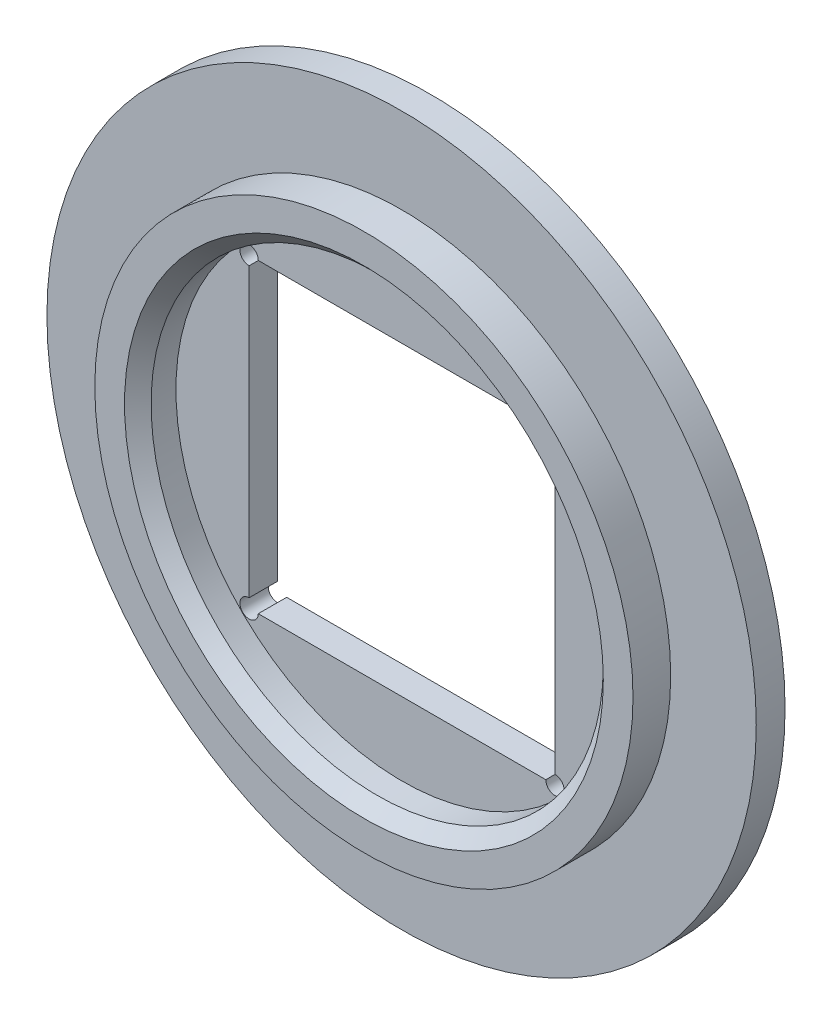
ISO-10303-21;
HEADER;
FILE_DESCRIPTION(('STEP AP214'),'2;1');
FILE_NAME('part.step','',(''),(''),'','','');
FILE_SCHEMA(('AUTOMOTIVE_DESIGN { 1 0 10303 214 1 1 1 1 }'));
ENDSEC;
DATA;
#1=APPLICATION_CONTEXT('core data for automotive mechanical design processes');
#2=APPLICATION_PROTOCOL_DEFINITION('international standard','automotive_design',2000,#1);
#3=PRODUCT_CONTEXT('',#1,'mechanical');
#4=PRODUCT('Part','Part','',(#3));
#5=PRODUCT_RELATED_PRODUCT_CATEGORY('part','',(#4));
#6=PRODUCT_DEFINITION_FORMATION('','',#4);
#7=PRODUCT_DEFINITION_CONTEXT('part definition',#1,'design');
#8=PRODUCT_DEFINITION('design','',#6,#7);
#9=PRODUCT_DEFINITION_SHAPE('','',#8);
#10=(LENGTH_UNIT() NAMED_UNIT(*) SI_UNIT(.MILLI.,.METRE.));
#11=(NAMED_UNIT(*) PLANE_ANGLE_UNIT() SI_UNIT($,.RADIAN.));
#12=(NAMED_UNIT(*) SI_UNIT($,.STERADIAN.) SOLID_ANGLE_UNIT());
#13=UNCERTAINTY_MEASURE_WITH_UNIT(LENGTH_MEASURE(1.E-05),#10,'distance_accuracy_value','');
#14=(GEOMETRIC_REPRESENTATION_CONTEXT(3) GLOBAL_UNCERTAINTY_ASSIGNED_CONTEXT((#13)) GLOBAL_UNIT_ASSIGNED_CONTEXT((#10,
#11,#12)) REPRESENTATION_CONTEXT('',''));
#15=CARTESIAN_POINT('',(0.,0.,0.));
#16=DIRECTION('',(0.,0.,1.));
#17=DIRECTION('',(1.,0.,0.));
#18=AXIS2_PLACEMENT_3D('',#15,#16,#17);
#19=CARTESIAN_POINT('',(3.45,-3.45,10.3980735803744));
#20=DIRECTION('',(-1.,0.,0.));
#21=DIRECTION('',(0.,0.,1.));
#22=AXIS2_PLACEMENT_3D('',#19,#20,#21);
#23=PLANE('',#22);
#24=DIRECTION('',(0.,1.,0.));
#25=VECTOR('',#24,1.);
#26=CARTESIAN_POINT('',(3.45,-3.45,0.));
#27=LINE('',#26,#25);
#28=CARTESIAN_POINT('',(3.45,-3.2426364551647,0.));
#29=VERTEX_POINT('',#28);
#30=CARTESIAN_POINT('',(3.45,3.2426364551647,0.));
#31=VERTEX_POINT('',#30);
#32=EDGE_CURVE('E131',#29,#31,#27,.T.);
#33=ORIENTED_EDGE('',*,*,#32,.F.);
#34=DIRECTION('',(0.,0.,-1.));
#35=VECTOR('',#34,1.);
#36=CARTESIAN_POINT('',(3.45,-3.2426364551647,1.22651267489567));
#37=LINE('',#36,#35);
#38=CARTESIAN_POINT('',(3.45,-3.2426364551647,0.64));
#39=VERTEX_POINT('',#38);
#40=EDGE_CURVE('E113',#29,#39,#37,.F.);
#41=ORIENTED_EDGE('',*,*,#40,.T.);
#42=DIRECTION('',(0.,1.,0.));
#43=VECTOR('',#42,1.);
#44=CARTESIAN_POINT('',(3.45,-3.45,0.64));
#45=LINE('',#44,#43);
#46=CARTESIAN_POINT('',(3.45,3.2426364551647,0.64));
#47=VERTEX_POINT('',#46);
#48=EDGE_CURVE('E129',#39,#47,#45,.T.);
#49=ORIENTED_EDGE('',*,*,#48,.T.);
#50=DIRECTION('',(0.,0.,-1.));
#51=VECTOR('',#50,1.);
#52=CARTESIAN_POINT('',(3.45,3.2426364551647,1.22651267489567));
#53=LINE('',#52,#51);
#54=EDGE_CURVE('E207',#47,#31,#53,.T.);
#55=ORIENTED_EDGE('',*,*,#54,.T.);
#56=EDGE_LOOP('',(#33,#41,#49,#55));
#57=FACE_BOUND('',#56,.T.);
#58=ADVANCED_FACE('F45',(#57),#23,.T.);
#59=CARTESIAN_POINT('',(-3.45,3.45,10.3980735803744));
#60=DIRECTION('',(0.,-1.,0.));
#61=DIRECTION('',(1.,0.,0.));
#62=AXIS2_PLACEMENT_3D('',#59,#60,#61);
#63=PLANE('',#62);
#64=DIRECTION('',(-1.,0.,0.));
#65=VECTOR('',#64,1.);
#66=CARTESIAN_POINT('',(-3.45,3.45,0.));
#67=LINE('',#66,#65);
#68=CARTESIAN_POINT('',(3.24263645516471,3.45,0.));
#69=VERTEX_POINT('',#68);
#70=CARTESIAN_POINT('',(-3.2426364551647,3.45,0.));
#71=VERTEX_POINT('',#70);
#72=EDGE_CURVE('E206',#69,#71,#67,.T.);
#73=ORIENTED_EDGE('',*,*,#72,.F.);
#74=DIRECTION('',(0.,0.,-1.));
#75=VECTOR('',#74,1.);
#76=CARTESIAN_POINT('',(3.24263645516471,3.45,1.22651267489567));
#77=LINE('',#76,#75);
#78=CARTESIAN_POINT('',(3.24263645516471,3.45,0.64));
#79=VERTEX_POINT('',#78);
#80=EDGE_CURVE('E11',#69,#79,#77,.F.);
#81=ORIENTED_EDGE('',*,*,#80,.T.);
#82=DIRECTION('',(-1.,0.,0.));
#83=VECTOR('',#82,1.);
#84=CARTESIAN_POINT('',(-3.45,3.45,0.64));
#85=LINE('',#84,#83);
#86=CARTESIAN_POINT('',(-3.2426364551647,3.45,0.64));
#87=VERTEX_POINT('',#86);
#88=EDGE_CURVE('E139',#79,#87,#85,.T.);
#89=ORIENTED_EDGE('',*,*,#88,.T.);
#90=DIRECTION('',(0.,0.,-1.));
#91=VECTOR('',#90,1.);
#92=CARTESIAN_POINT('',(-3.2426364551647,3.45,1.22651267489567));
#93=LINE('',#92,#91);
#94=EDGE_CURVE('E218',#87,#71,#93,.T.);
#95=ORIENTED_EDGE('',*,*,#94,.T.);
#96=EDGE_LOOP('',(#73,#81,#89,#95));
#97=FACE_BOUND('',#96,.T.);
#98=ADVANCED_FACE('F244',(#97),#63,.T.);
#99=CARTESIAN_POINT('',(-3.45,3.45,10.3980735803744));
#100=DIRECTION('',(1.,0.,0.));
#101=DIRECTION('',(0.,1.,0.));
#102=AXIS2_PLACEMENT_3D('',#99,#100,#101);
#103=PLANE('',#102);
#104=DIRECTION('',(0.,-1.,0.));
#105=VECTOR('',#104,1.);
#106=CARTESIAN_POINT('',(-3.45,3.45,0.64));
#107=LINE('',#106,#105);
#108=CARTESIAN_POINT('',(-3.45,3.2426364551647,0.64));
#109=VERTEX_POINT('',#108);
#110=CARTESIAN_POINT('',(-3.45,-3.2426364551647,0.64));
#111=VERTEX_POINT('',#110);
#112=EDGE_CURVE('E147',#109,#111,#107,.T.);
#113=ORIENTED_EDGE('',*,*,#112,.T.);
#114=DIRECTION('',(0.,0.,-1.));
#115=VECTOR('',#114,1.);
#116=CARTESIAN_POINT('',(-3.45,-3.2426364551647,1.22651267489567));
#117=LINE('',#116,#115);
#118=CARTESIAN_POINT('',(-3.45,-3.2426364551647,0.));
#119=VERTEX_POINT('',#118);
#120=EDGE_CURVE('E133',#111,#119,#117,.T.);
#121=ORIENTED_EDGE('',*,*,#120,.T.);
#122=DIRECTION('',(0.,-1.,0.));
#123=VECTOR('',#122,1.);
#124=CARTESIAN_POINT('',(-3.45,3.45,0.));
#125=LINE('',#124,#123);
#126=CARTESIAN_POINT('',(-3.45,3.2426364551647,0.));
#127=VERTEX_POINT('',#126);
#128=EDGE_CURVE('E195',#127,#119,#125,.T.);
#129=ORIENTED_EDGE('',*,*,#128,.F.);
#130=DIRECTION('',(0.,0.,-1.));
#131=VECTOR('',#130,1.);
#132=CARTESIAN_POINT('',(-3.45,3.2426364551647,1.22651267489567));
#133=LINE('',#132,#131);
#134=EDGE_CURVE('E55',#127,#109,#133,.F.);
#135=ORIENTED_EDGE('',*,*,#134,.T.);
#136=EDGE_LOOP('',(#113,#121,#129,#135));
#137=FACE_BOUND('',#136,.T.);
#138=ADVANCED_FACE('F192',(#137),#103,.T.);
#139=CARTESIAN_POINT('',(-3.45,-3.45,10.3980735803744));
#140=DIRECTION('',(0.,1.,0.));
#141=DIRECTION('',(0.,0.,1.));
#142=AXIS2_PLACEMENT_3D('',#139,#140,#141);
#143=PLANE('',#142);
#144=DIRECTION('',(1.,0.,0.));
#145=VECTOR('',#144,1.);
#146=CARTESIAN_POINT('',(-3.45,-3.45,0.));
#147=LINE('',#146,#145);
#148=CARTESIAN_POINT('',(-3.24263645516471,-3.45,0.));
#149=VERTEX_POINT('',#148);
#150=CARTESIAN_POINT('',(3.2426364551647,-3.45,0.));
#151=VERTEX_POINT('',#150);
#152=EDGE_CURVE('E150',#149,#151,#147,.T.);
#153=ORIENTED_EDGE('',*,*,#152,.F.);
#154=DIRECTION('',(0.,0.,-1.));
#155=VECTOR('',#154,1.);
#156=CARTESIAN_POINT('',(-3.24263645516471,-3.45,1.22651267489567));
#157=LINE('',#156,#155);
#158=CARTESIAN_POINT('',(-3.24263645516471,-3.45,0.64));
#159=VERTEX_POINT('',#158);
#160=EDGE_CURVE('E183',#149,#159,#157,.F.);
#161=ORIENTED_EDGE('',*,*,#160,.T.);
#162=DIRECTION('',(1.,0.,0.));
#163=VECTOR('',#162,1.);
#164=CARTESIAN_POINT('',(-3.45,-3.45,0.64));
#165=LINE('',#164,#163);
#166=CARTESIAN_POINT('',(3.2426364551647,-3.45,0.64));
#167=VERTEX_POINT('',#166);
#168=EDGE_CURVE('E140',#159,#167,#165,.T.);
#169=ORIENTED_EDGE('',*,*,#168,.T.);
#170=DIRECTION('',(0.,0.,-1.));
#171=VECTOR('',#170,1.);
#172=CARTESIAN_POINT('',(3.2426364551647,-3.45,1.22651267489567));
#173=LINE('',#172,#171);
#174=EDGE_CURVE('E116',#167,#151,#173,.T.);
#175=ORIENTED_EDGE('',*,*,#174,.T.);
#176=EDGE_LOOP('',(#153,#161,#169,#175));
#177=FACE_BOUND('',#176,.T.);
#178=ADVANCED_FACE('F249',(#177),#143,.T.);
#179=CARTESIAN_POINT('',(0.,0.,0.));
#180=DIRECTION('',(0.,0.,1.));
#181=DIRECTION('',(1.,0.,0.));
#182=AXIS2_PLACEMENT_3D('',#179,#180,#181);
#183=PLANE('',#182);
#184=CARTESIAN_POINT('',(-3.45,-3.45,0.));
#185=DIRECTION('',(0.,0.,1.));
#186=DIRECTION('',(1.,0.,0.));
#187=AXIS2_PLACEMENT_3D('',#184,#185,#186);
#188=CIRCLE('',#187,0.207363544835296);
#189=EDGE_CURVE('E229',#119,#149,#188,.T.);
#190=ORIENTED_EDGE('',*,*,#189,.T.);
#191=ORIENTED_EDGE('',*,*,#152,.T.);
#192=CARTESIAN_POINT('',(3.45,-3.45,0.));
#193=DIRECTION('',(0.,0.,1.));
#194=DIRECTION('',(1.,0.,0.));
#195=AXIS2_PLACEMENT_3D('',#192,#193,#194);
#196=CIRCLE('',#195,0.207363544835296);
#197=EDGE_CURVE('E123',#151,#29,#196,.T.);
#198=ORIENTED_EDGE('',*,*,#197,.T.);
#199=ORIENTED_EDGE('',*,*,#32,.T.);
#200=CARTESIAN_POINT('',(3.45,3.45,0.));
#201=DIRECTION('',(0.,0.,1.));
#202=DIRECTION('',(1.,0.,0.));
#203=AXIS2_PLACEMENT_3D('',#200,#201,#202);
#204=CIRCLE('',#203,0.207363544835296);
#205=EDGE_CURVE('E122',#31,#69,#204,.T.);
#206=ORIENTED_EDGE('',*,*,#205,.T.);
#207=ORIENTED_EDGE('',*,*,#72,.T.);
#208=CARTESIAN_POINT('',(-3.45,3.45,0.));
#209=DIRECTION('',(0.,0.,1.));
#210=DIRECTION('',(1.,0.,0.));
#211=AXIS2_PLACEMENT_3D('',#208,#209,#210);
#212=CIRCLE('',#211,0.207363544835296);
#213=EDGE_CURVE('E224',#71,#127,#212,.T.);
#214=ORIENTED_EDGE('',*,*,#213,.T.);
#215=ORIENTED_EDGE('',*,*,#128,.T.);
#216=EDGE_LOOP('',(#190,#191,#198,#199,#206,#207,#214,#215));
#217=FACE_BOUND('',#216,.T.);
#218=CARTESIAN_POINT('',(0.,0.,0.));
#219=DIRECTION('',(0.,0.,1.));
#220=DIRECTION('',(1.,0.,0.));
#221=AXIS2_PLACEMENT_3D('',#218,#219,#220);
#222=CIRCLE('',#221,8.);
#223=CARTESIAN_POINT('',(8.,0.,0.));
#224=VERTEX_POINT('',#223);
#225=EDGE_CURVE('E163',#224,#224,#222,.T.);
#226=ORIENTED_EDGE('',*,*,#225,.F.);
#227=EDGE_LOOP('',(#226));
#228=FACE_BOUND('',#227,.T.);
#229=ADVANCED_FACE('F241',(#217,#228),#183,.F.);
#230=CARTESIAN_POINT('',(0.,0.,0.65));
#231=DIRECTION('',(0.,0.,-1.));
#232=DIRECTION('',(-1.,0.,0.));
#233=AXIS2_PLACEMENT_3D('',#230,#231,#232);
#234=CYLINDRICAL_SURFACE('',#233,8.);
#235=CARTESIAN_POINT('',(0.,0.,0.65));
#236=DIRECTION('',(0.,0.,1.));
#237=DIRECTION('',(1.,0.,0.));
#238=AXIS2_PLACEMENT_3D('',#235,#236,#237);
#239=CIRCLE('',#238,8.);
#240=CARTESIAN_POINT('',(8.,0.,0.65));
#241=VERTEX_POINT('',#240);
#242=EDGE_CURVE('E167',#241,#241,#239,.T.);
#243=ORIENTED_EDGE('',*,*,#242,.F.);
#244=EDGE_LOOP('',(#243));
#245=FACE_BOUND('',#244,.T.);
#246=ORIENTED_EDGE('',*,*,#225,.T.);
#247=EDGE_LOOP('',(#246));
#248=FACE_BOUND('',#247,.T.);
#249=ADVANCED_FACE('F285',(#245,#248),#234,.T.);
#250=CARTESIAN_POINT('',(0.,0.,0.65));
#251=DIRECTION('',(0.,0.,1.));
#252=DIRECTION('',(1.,0.,0.));
#253=AXIS2_PLACEMENT_3D('',#250,#251,#252);
#254=PLANE('',#253);
#255=CARTESIAN_POINT('',(0.,0.,0.65));
#256=DIRECTION('',(0.,0.,1.));
#257=DIRECTION('',(1.,0.,0.));
#258=AXIS2_PLACEMENT_3D('',#255,#256,#257);
#259=CIRCLE('',#258,6.07);
#260=CARTESIAN_POINT('',(6.07,0.,0.65));
#261=VERTEX_POINT('',#260);
#262=EDGE_CURVE('E158',#261,#261,#259,.T.);
#263=ORIENTED_EDGE('',*,*,#262,.F.);
#264=EDGE_LOOP('',(#263));
#265=FACE_BOUND('',#264,.T.);
#266=ORIENTED_EDGE('',*,*,#242,.T.);
#267=EDGE_LOOP('',(#266));
#268=FACE_BOUND('',#267,.T.);
#269=ADVANCED_FACE('F278',(#265,#268),#254,.T.);
#270=CARTESIAN_POINT('',(0.,0.,1.5));
#271=DIRECTION('',(0.,0.,1.));
#272=DIRECTION('',(1.,0.,0.));
#273=AXIS2_PLACEMENT_3D('',#270,#271,#272);
#274=PLANE('',#273);
#275=CARTESIAN_POINT('',(0.,0.,1.5));
#276=DIRECTION('',(0.,0.,1.));
#277=DIRECTION('',(1.,0.,0.));
#278=AXIS2_PLACEMENT_3D('',#275,#276,#277);
#279=CIRCLE('',#278,5.40000000000001);
#280=CARTESIAN_POINT('',(5.40000000000001,0.,1.5));
#281=VERTEX_POINT('',#280);
#282=EDGE_CURVE('E177',#281,#281,#279,.F.);
#283=ORIENTED_EDGE('',*,*,#282,.T.);
#284=EDGE_LOOP('',(#283));
#285=FACE_BOUND('',#284,.T.);
#286=CARTESIAN_POINT('',(0.,0.,1.5));
#287=DIRECTION('',(0.,0.,1.));
#288=DIRECTION('',(1.,0.,0.));
#289=AXIS2_PLACEMENT_3D('',#286,#287,#288);
#290=CIRCLE('',#289,6.07);
#291=CARTESIAN_POINT('',(6.07,0.,1.5));
#292=VERTEX_POINT('',#291);
#293=EDGE_CURVE('E159',#292,#292,#290,.T.);
#294=ORIENTED_EDGE('',*,*,#293,.T.);
#295=EDGE_LOOP('',(#294));
#296=FACE_BOUND('',#295,.T.);
#297=ADVANCED_FACE('F275',(#285,#296),#274,.T.);
#298=CARTESIAN_POINT('',(0.,0.,1.5));
#299=DIRECTION('',(0.,0.,-1.));
#300=DIRECTION('',(-1.,0.,0.));
#301=AXIS2_PLACEMENT_3D('',#298,#299,#300);
#302=CYLINDRICAL_SURFACE('',#301,6.07);
#303=ORIENTED_EDGE('',*,*,#293,.F.);
#304=EDGE_LOOP('',(#303));
#305=FACE_BOUND('',#304,.T.);
#306=ORIENTED_EDGE('',*,*,#262,.T.);
#307=EDGE_LOOP('',(#306));
#308=FACE_BOUND('',#307,.T.);
#309=ADVANCED_FACE('F273',(#305,#308),#302,.T.);
#310=CARTESIAN_POINT('',(0.,0.,1.5));
#311=DIRECTION('',(0.,0.,-1.));
#312=DIRECTION('',(-1.,0.,0.));
#313=AXIS2_PLACEMENT_3D('',#310,#311,#312);
#314=CYLINDRICAL_SURFACE('',#313,5.1);
#315=CARTESIAN_POINT('',(0.,0.,1.2));
#316=DIRECTION('',(0.,0.,1.));
#317=DIRECTION('',(1.,0.,0.));
#318=AXIS2_PLACEMENT_3D('',#315,#316,#317);
#319=CIRCLE('',#318,5.1);
#320=CARTESIAN_POINT('',(5.1,0.,1.2));
#321=VERTEX_POINT('',#320);
#322=EDGE_CURVE('E170',#321,#321,#319,.T.);
#323=ORIENTED_EDGE('',*,*,#322,.T.);
#324=EDGE_LOOP('',(#323));
#325=FACE_BOUND('',#324,.T.);
#326=CARTESIAN_POINT('',(0.,0.,0.64));
#327=DIRECTION('',(0.,0.,1.));
#328=DIRECTION('',(1.,0.,0.));
#329=AXIS2_PLACEMENT_3D('',#326,#327,#328);
#330=CIRCLE('',#329,5.1);
#331=CARTESIAN_POINT('',(5.1,0.,0.64));
#332=VERTEX_POINT('',#331);
#333=EDGE_CURVE('E154',#332,#332,#330,.T.);
#334=ORIENTED_EDGE('',*,*,#333,.F.);
#335=EDGE_LOOP('',(#334));
#336=FACE_BOUND('',#335,.T.);
#337=ADVANCED_FACE('F270',(#325,#336),#314,.F.);
#338=CARTESIAN_POINT('',(0.,0.,0.64));
#339=DIRECTION('',(0.,0.,1.));
#340=DIRECTION('',(1.,0.,0.));
#341=AXIS2_PLACEMENT_3D('',#338,#339,#340);
#342=PLANE('',#341);
#343=ORIENTED_EDGE('',*,*,#168,.F.);
#344=CARTESIAN_POINT('',(-3.45,-3.45,0.64));
#345=DIRECTION('',(0.,0.,1.));
#346=DIRECTION('',(1.,0.,0.));
#347=AXIS2_PLACEMENT_3D('',#344,#345,#346);
#348=CIRCLE('',#347,0.207363544835296);
#349=EDGE_CURVE('E198',#111,#159,#348,.T.);
#350=ORIENTED_EDGE('',*,*,#349,.F.);
#351=ORIENTED_EDGE('',*,*,#112,.F.);
#352=CARTESIAN_POINT('',(-3.45,3.45,0.64));
#353=DIRECTION('',(0.,0.,1.));
#354=DIRECTION('',(1.,0.,0.));
#355=AXIS2_PLACEMENT_3D('',#352,#353,#354);
#356=CIRCLE('',#355,0.207363544835296);
#357=EDGE_CURVE('E69',#87,#109,#356,.T.);
#358=ORIENTED_EDGE('',*,*,#357,.F.);
#359=ORIENTED_EDGE('',*,*,#88,.F.);
#360=CARTESIAN_POINT('',(3.45,3.45,0.64));
#361=DIRECTION('',(0.,0.,1.));
#362=DIRECTION('',(1.,0.,0.));
#363=AXIS2_PLACEMENT_3D('',#360,#361,#362);
#364=CIRCLE('',#363,0.207363544835296);
#365=EDGE_CURVE('E62',#47,#79,#364,.T.);
#366=ORIENTED_EDGE('',*,*,#365,.F.);
#367=ORIENTED_EDGE('',*,*,#48,.F.);
#368=CARTESIAN_POINT('',(3.45,-3.45,0.64));
#369=DIRECTION('',(0.,0.,1.));
#370=DIRECTION('',(1.,0.,0.));
#371=AXIS2_PLACEMENT_3D('',#368,#369,#370);
#372=CIRCLE('',#371,0.207363544835296);
#373=EDGE_CURVE('E110',#167,#39,#372,.T.);
#374=ORIENTED_EDGE('',*,*,#373,.F.);
#375=EDGE_LOOP('',(#343,#350,#351,#358,#359,#366,#367,#374));
#376=FACE_BOUND('',#375,.T.);
#377=ORIENTED_EDGE('',*,*,#333,.T.);
#378=EDGE_LOOP('',(#377));
#379=FACE_BOUND('',#378,.T.);
#380=ADVANCED_FACE('F135',(#376,#379),#342,.T.);
#381=CARTESIAN_POINT('',(0.,0.,1.2));
#382=DIRECTION('',(0.,0.,1.));
#383=DIRECTION('',(1.,0.,0.));
#384=AXIS2_PLACEMENT_3D('',#381,#382,#383);
#385=CONICAL_SURFACE('',#384,5.1,0.785398163397457);
#386=ORIENTED_EDGE('',*,*,#282,.F.);
#387=EDGE_LOOP('',(#386));
#388=FACE_BOUND('',#387,.T.);
#389=ORIENTED_EDGE('',*,*,#322,.F.);
#390=EDGE_LOOP('',(#389));
#391=FACE_BOUND('',#390,.T.);
#392=ADVANCED_FACE('F48',(#388,#391),#385,.F.);
#393=CARTESIAN_POINT('',(3.45,-3.45,1.22651267489567));
#394=DIRECTION('',(0.,0.,-1.));
#395=DIRECTION('',(-1.,0.,0.));
#396=AXIS2_PLACEMENT_3D('',#393,#394,#395);
#397=CYLINDRICAL_SURFACE('',#396,0.207363544835296);
#398=ORIENTED_EDGE('',*,*,#197,.F.);
#399=ORIENTED_EDGE('',*,*,#174,.F.);
#400=ORIENTED_EDGE('',*,*,#373,.T.);
#401=ORIENTED_EDGE('',*,*,#40,.F.);
#402=EDGE_LOOP('',(#398,#399,#400,#401));
#403=FACE_BOUND('',#402,.T.);
#404=ADVANCED_FACE('F112',(#403),#397,.F.);
#405=CARTESIAN_POINT('',(-3.45,-3.45,1.22651267489567));
#406=DIRECTION('',(0.,0.,-1.));
#407=DIRECTION('',(-1.,0.,0.));
#408=AXIS2_PLACEMENT_3D('',#405,#406,#407);
#409=CYLINDRICAL_SURFACE('',#408,0.207363544835296);
#410=ORIENTED_EDGE('',*,*,#349,.T.);
#411=ORIENTED_EDGE('',*,*,#160,.F.);
#412=ORIENTED_EDGE('',*,*,#189,.F.);
#413=ORIENTED_EDGE('',*,*,#120,.F.);
#414=EDGE_LOOP('',(#410,#411,#412,#413));
#415=FACE_BOUND('',#414,.T.);
#416=ADVANCED_FACE('F250',(#415),#409,.F.);
#417=CARTESIAN_POINT('',(-3.45,3.45,1.22651267489567));
#418=DIRECTION('',(0.,0.,-1.));
#419=DIRECTION('',(-1.,0.,0.));
#420=AXIS2_PLACEMENT_3D('',#417,#418,#419);
#421=CYLINDRICAL_SURFACE('',#420,0.207363544835296);
#422=ORIENTED_EDGE('',*,*,#357,.T.);
#423=ORIENTED_EDGE('',*,*,#134,.F.);
#424=ORIENTED_EDGE('',*,*,#213,.F.);
#425=ORIENTED_EDGE('',*,*,#94,.F.);
#426=EDGE_LOOP('',(#422,#423,#424,#425));
#427=FACE_BOUND('',#426,.T.);
#428=ADVANCED_FACE('F245',(#427),#421,.F.);
#429=CARTESIAN_POINT('',(3.45,3.45,1.22651267489567));
#430=DIRECTION('',(0.,0.,-1.));
#431=DIRECTION('',(-1.,0.,0.));
#432=AXIS2_PLACEMENT_3D('',#429,#430,#431);
#433=CYLINDRICAL_SURFACE('',#432,0.207363544835296);
#434=ORIENTED_EDGE('',*,*,#365,.T.);
#435=ORIENTED_EDGE('',*,*,#80,.F.);
#436=ORIENTED_EDGE('',*,*,#205,.F.);
#437=ORIENTED_EDGE('',*,*,#54,.F.);
#438=EDGE_LOOP('',(#434,#435,#436,#437));
#439=FACE_BOUND('',#438,.T.);
#440=ADVANCED_FACE('F257',(#439),#433,.F.);
#441=CLOSED_SHELL('',(#58,#98,#138,#178,#229,#249,#269,#297,#309,#337,#380,#392,#404,#416,#428,#440));
#442=MANIFOLD_SOLID_BREP('B2',#441);
#443=ADVANCED_BREP_SHAPE_REPRESENTATION('',(#18,#442),#14);
#444=SHAPE_DEFINITION_REPRESENTATION(#9,#443);
ENDSEC;
END-ISO-10303-21;
